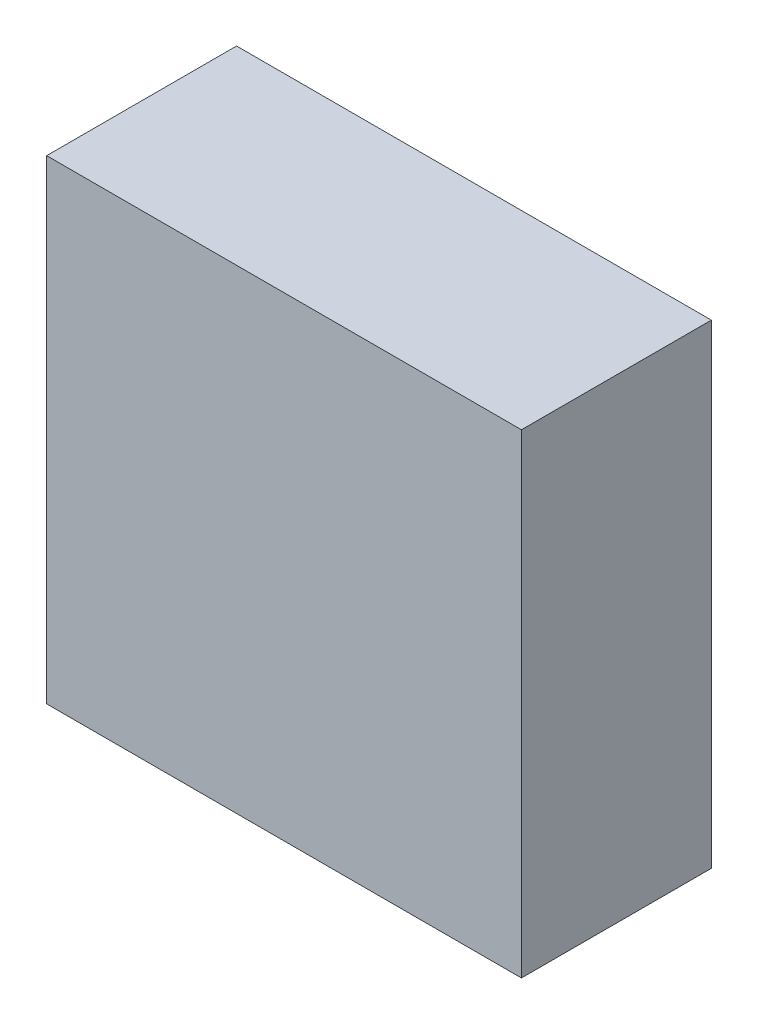
ISO-10303-21;
HEADER;
FILE_DESCRIPTION(('STEP AP214'),'2;1');
FILE_NAME('part.step','',(''),(''),'','','');
FILE_SCHEMA(('AUTOMOTIVE_DESIGN { 1 0 10303 214 1 1 1 1 }'));
ENDSEC;
DATA;
#1=APPLICATION_CONTEXT('core data for automotive mechanical design processes');
#2=APPLICATION_PROTOCOL_DEFINITION('international standard','automotive_design',2000,#1);
#3=PRODUCT_CONTEXT('',#1,'mechanical');
#4=PRODUCT('Part','Part','',(#3));
#5=PRODUCT_RELATED_PRODUCT_CATEGORY('part','',(#4));
#6=PRODUCT_DEFINITION_FORMATION('','',#4);
#7=PRODUCT_DEFINITION_CONTEXT('part definition',#1,'design');
#8=PRODUCT_DEFINITION('design','',#6,#7);
#9=PRODUCT_DEFINITION_SHAPE('','',#8);
#10=(LENGTH_UNIT() NAMED_UNIT(*) SI_UNIT(.MILLI.,.METRE.));
#11=(NAMED_UNIT(*) PLANE_ANGLE_UNIT() SI_UNIT($,.RADIAN.));
#12=(NAMED_UNIT(*) SI_UNIT($,.STERADIAN.) SOLID_ANGLE_UNIT());
#13=UNCERTAINTY_MEASURE_WITH_UNIT(LENGTH_MEASURE(1.E-05),#10,'distance_accuracy_value','');
#14=(GEOMETRIC_REPRESENTATION_CONTEXT(3) GLOBAL_UNCERTAINTY_ASSIGNED_CONTEXT((#13)) GLOBAL_UNIT_ASSIGNED_CONTEXT((#10,
#11,#12)) REPRESENTATION_CONTEXT('',''));
#15=CARTESIAN_POINT('',(0.,0.,0.));
#16=DIRECTION('',(0.,0.,1.));
#17=DIRECTION('',(1.,0.,0.));
#18=AXIS2_PLACEMENT_3D('',#15,#16,#17);
#19=CARTESIAN_POINT('',(1.00000054,1.00000054,0.80000094));
#20=DIRECTION('',(0.,0.,-1.));
#21=DIRECTION('',(-1.,0.,0.));
#22=AXIS2_PLACEMENT_3D('',#19,#20,#21);
#23=PLANE('',#22);
#24=DIRECTION('',(0.,1.,0.));
#25=VECTOR('',#24,1.);
#26=CARTESIAN_POINT('',(-1.00000054,1.00000054,0.80000094));
#27=LINE('',#26,#25);
#28=CARTESIAN_POINT('',(-1.00000054,1.00000054,0.80000094));
#29=VERTEX_POINT('',#28);
#30=CARTESIAN_POINT('',(-1.00000054,-1.00000054,0.80000094));
#31=VERTEX_POINT('',#30);
#32=EDGE_CURVE('E55',#29,#31,#27,.F.);
#33=ORIENTED_EDGE('',*,*,#32,.T.);
#34=DIRECTION('',(1.,0.,0.));
#35=VECTOR('',#34,1.);
#36=CARTESIAN_POINT('',(-1.00000054,-1.00000054,0.80000094));
#37=LINE('',#36,#35);
#38=CARTESIAN_POINT('',(1.00000054,-1.00000054,0.80000094));
#39=VERTEX_POINT('',#38);
#40=EDGE_CURVE('E57',#31,#39,#37,.T.);
#41=ORIENTED_EDGE('',*,*,#40,.T.);
#42=DIRECTION('',(0.,1.,0.));
#43=VECTOR('',#42,1.);
#44=CARTESIAN_POINT('',(1.00000054,-1.00000054,0.80000094));
#45=LINE('',#44,#43);
#46=CARTESIAN_POINT('',(1.00000054,1.00000054,0.80000094));
#47=VERTEX_POINT('',#46);
#48=EDGE_CURVE('E20',#39,#47,#45,.T.);
#49=ORIENTED_EDGE('',*,*,#48,.T.);
#50=DIRECTION('',(1.,0.,0.));
#51=VECTOR('',#50,1.);
#52=CARTESIAN_POINT('',(1.00000054,1.00000054,0.80000094));
#53=LINE('',#52,#51);
#54=EDGE_CURVE('E80',#47,#29,#53,.F.);
#55=ORIENTED_EDGE('',*,*,#54,.T.);
#56=EDGE_LOOP('',(#33,#41,#49,#55));
#57=FACE_BOUND('',#56,.T.);
#58=ADVANCED_FACE('F17',(#57),#23,.F.);
#59=CARTESIAN_POINT('',(1.00000054,-1.00000054,0.));
#60=DIRECTION('',(-1.,0.,0.));
#61=DIRECTION('',(0.,0.,1.));
#62=AXIS2_PLACEMENT_3D('',#59,#60,#61);
#63=PLANE('',#62);
#64=DIRECTION('',(0.,0.,-1.));
#65=VECTOR('',#64,1.);
#66=CARTESIAN_POINT('',(1.00000054,1.00000054,0.));
#67=LINE('',#66,#65);
#68=CARTESIAN_POINT('',(1.00000054,1.00000054,0.));
#69=VERTEX_POINT('',#68);
#70=EDGE_CURVE('E68',#69,#47,#67,.F.);
#71=ORIENTED_EDGE('',*,*,#70,.T.);
#72=ORIENTED_EDGE('',*,*,#48,.F.);
#73=DIRECTION('',(0.,0.,1.));
#74=VECTOR('',#73,1.);
#75=CARTESIAN_POINT('',(1.00000054,-1.00000054,0.));
#76=LINE('',#75,#74);
#77=CARTESIAN_POINT('',(1.00000054,-1.00000054,0.));
#78=VERTEX_POINT('',#77);
#79=EDGE_CURVE('E63',#39,#78,#76,.F.);
#80=ORIENTED_EDGE('',*,*,#79,.T.);
#81=DIRECTION('',(0.,1.,0.));
#82=VECTOR('',#81,1.);
#83=CARTESIAN_POINT('',(1.00000054,1.00000054,0.));
#84=LINE('',#83,#82);
#85=EDGE_CURVE('E83',#69,#78,#84,.F.);
#86=ORIENTED_EDGE('',*,*,#85,.F.);
#87=EDGE_LOOP('',(#71,#72,#80,#86));
#88=FACE_BOUND('',#87,.T.);
#89=ADVANCED_FACE('F65',(#88),#63,.F.);
#90=CARTESIAN_POINT('',(-1.00000054,-1.00000054,0.));
#91=DIRECTION('',(0.,1.,0.));
#92=DIRECTION('',(0.,0.,1.));
#93=AXIS2_PLACEMENT_3D('',#90,#91,#92);
#94=PLANE('',#93);
#95=ORIENTED_EDGE('',*,*,#79,.F.);
#96=ORIENTED_EDGE('',*,*,#40,.F.);
#97=DIRECTION('',(0.,0.,-1.));
#98=VECTOR('',#97,1.);
#99=CARTESIAN_POINT('',(-1.00000054,-1.00000054,0.));
#100=LINE('',#99,#98);
#101=CARTESIAN_POINT('',(-1.00000054,-1.00000054,0.));
#102=VERTEX_POINT('',#101);
#103=EDGE_CURVE('E75',#31,#102,#100,.T.);
#104=ORIENTED_EDGE('',*,*,#103,.T.);
#105=DIRECTION('',(-1.,0.,0.));
#106=VECTOR('',#105,1.);
#107=CARTESIAN_POINT('',(1.00000054,-1.00000054,0.));
#108=LINE('',#107,#106);
#109=EDGE_CURVE('E72',#78,#102,#108,.T.);
#110=ORIENTED_EDGE('',*,*,#109,.F.);
#111=EDGE_LOOP('',(#95,#96,#104,#110));
#112=FACE_BOUND('',#111,.T.);
#113=ADVANCED_FACE('F70',(#112),#94,.F.);
#114=CARTESIAN_POINT('',(-1.00000054,1.00000054,0.));
#115=DIRECTION('',(1.,0.,0.));
#116=DIRECTION('',(0.,0.,-1.));
#117=AXIS2_PLACEMENT_3D('',#114,#115,#116);
#118=PLANE('',#117);
#119=ORIENTED_EDGE('',*,*,#103,.F.);
#120=ORIENTED_EDGE('',*,*,#32,.F.);
#121=DIRECTION('',(0.,0.,-1.));
#122=VECTOR('',#121,1.);
#123=CARTESIAN_POINT('',(-1.00000054,1.00000054,0.));
#124=LINE('',#123,#122);
#125=CARTESIAN_POINT('',(-1.00000054,1.00000054,0.));
#126=VERTEX_POINT('',#125);
#127=EDGE_CURVE('E35',#29,#126,#124,.T.);
#128=ORIENTED_EDGE('',*,*,#127,.T.);
#129=DIRECTION('',(0.,1.,0.));
#130=VECTOR('',#129,1.);
#131=CARTESIAN_POINT('',(-1.00000054,1.00000054,0.));
#132=LINE('',#131,#130);
#133=EDGE_CURVE('E26',#102,#126,#132,.T.);
#134=ORIENTED_EDGE('',*,*,#133,.F.);
#135=EDGE_LOOP('',(#119,#120,#128,#134));
#136=FACE_BOUND('',#135,.T.);
#137=ADVANCED_FACE('F89',(#136),#118,.F.);
#138=CARTESIAN_POINT('',(1.00000054,1.00000054,0.));
#139=DIRECTION('',(0.,-1.,0.));
#140=DIRECTION('',(0.,0.,-1.));
#141=AXIS2_PLACEMENT_3D('',#138,#139,#140);
#142=PLANE('',#141);
#143=ORIENTED_EDGE('',*,*,#127,.F.);
#144=ORIENTED_EDGE('',*,*,#54,.F.);
#145=ORIENTED_EDGE('',*,*,#70,.F.);
#146=DIRECTION('',(-1.,0.,0.));
#147=VECTOR('',#146,1.);
#148=CARTESIAN_POINT('',(1.00000054,1.00000054,0.));
#149=LINE('',#148,#147);
#150=EDGE_CURVE('E11',#126,#69,#149,.F.);
#151=ORIENTED_EDGE('',*,*,#150,.F.);
#152=EDGE_LOOP('',(#143,#144,#145,#151));
#153=FACE_BOUND('',#152,.T.);
#154=ADVANCED_FACE('F91',(#153),#142,.F.);
#155=CARTESIAN_POINT('',(1.00000054,1.00000054,0.));
#156=DIRECTION('',(0.,0.,-1.));
#157=DIRECTION('',(-1.,0.,0.));
#158=AXIS2_PLACEMENT_3D('',#155,#156,#157);
#159=PLANE('',#158);
#160=ORIENTED_EDGE('',*,*,#133,.T.);
#161=ORIENTED_EDGE('',*,*,#150,.T.);
#162=ORIENTED_EDGE('',*,*,#85,.T.);
#163=ORIENTED_EDGE('',*,*,#109,.T.);
#164=EDGE_LOOP('',(#160,#161,#162,#163));
#165=FACE_BOUND('',#164,.T.);
#166=ADVANCED_FACE('F88',(#165),#159,.T.);
#167=CLOSED_SHELL('',(#58,#89,#113,#137,#154,#166));
#168=MANIFOLD_SOLID_BREP('B1',#167);
#169=ADVANCED_BREP_SHAPE_REPRESENTATION('',(#18,#168),#14);
#170=SHAPE_DEFINITION_REPRESENTATION(#9,#169);
ENDSEC;
END-ISO-10303-21;
